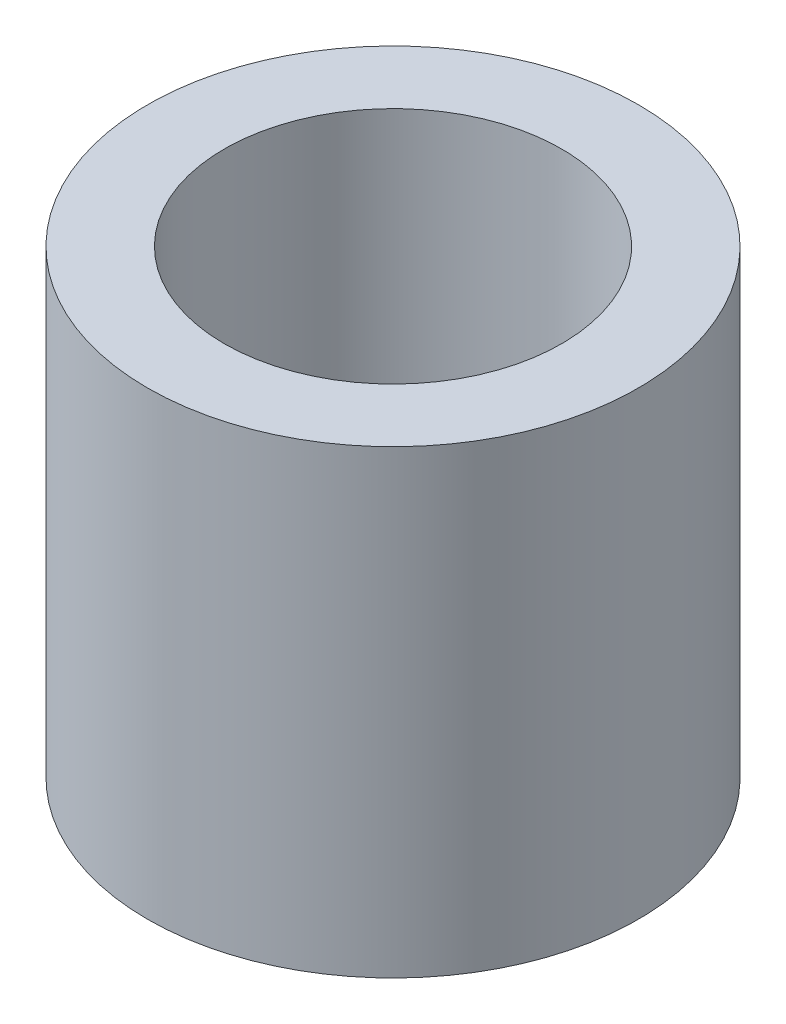
ISO-10303-21;
HEADER;
FILE_DESCRIPTION(('STEP AP214'),'2;1');
FILE_NAME('part.step','',(''),(''),'','','');
FILE_SCHEMA(('AUTOMOTIVE_DESIGN { 1 0 10303 214 1 1 1 1 }'));
ENDSEC;
DATA;
#1=APPLICATION_CONTEXT('core data for automotive mechanical design processes');
#2=APPLICATION_PROTOCOL_DEFINITION('international standard','automotive_design',2000,#1);
#3=PRODUCT_CONTEXT('',#1,'mechanical');
#4=PRODUCT('Part','Part','',(#3));
#5=PRODUCT_RELATED_PRODUCT_CATEGORY('part','',(#4));
#6=PRODUCT_DEFINITION_FORMATION('','',#4);
#7=PRODUCT_DEFINITION_CONTEXT('part definition',#1,'design');
#8=PRODUCT_DEFINITION('design','',#6,#7);
#9=PRODUCT_DEFINITION_SHAPE('','',#8);
#10=(LENGTH_UNIT() NAMED_UNIT(*) SI_UNIT(.MILLI.,.METRE.));
#11=(NAMED_UNIT(*) PLANE_ANGLE_UNIT() SI_UNIT($,.RADIAN.));
#12=(NAMED_UNIT(*) SI_UNIT($,.STERADIAN.) SOLID_ANGLE_UNIT());
#13=UNCERTAINTY_MEASURE_WITH_UNIT(LENGTH_MEASURE(1.E-05),#10,'distance_accuracy_value','');
#14=(GEOMETRIC_REPRESENTATION_CONTEXT(3) GLOBAL_UNCERTAINTY_ASSIGNED_CONTEXT((#13)) GLOBAL_UNIT_ASSIGNED_CONTEXT((#10,
#11,#12)) REPRESENTATION_CONTEXT('',''));
#15=CARTESIAN_POINT('',(0.,0.,0.));
#16=DIRECTION('',(0.,0.,1.));
#17=DIRECTION('',(1.,0.,0.));
#18=AXIS2_PLACEMENT_3D('',#15,#16,#17);
#19=CARTESIAN_POINT('',(0.,2.,0.));
#20=DIRECTION('',(0.,-1.,0.));
#21=DIRECTION('',(0.,0.,-1.));
#22=AXIS2_PLACEMENT_3D('',#19,#20,#21);
#23=CYLINDRICAL_SURFACE('',#22,1.25);
#24=CARTESIAN_POINT('',(0.,2.,0.));
#25=DIRECTION('',(0.,1.,0.));
#26=DIRECTION('',(0.,0.,1.));
#27=AXIS2_PLACEMENT_3D('',#24,#25,#26);
#28=CIRCLE('',#27,1.25);
#29=CARTESIAN_POINT('',(0.,2.,1.25));
#30=VERTEX_POINT('',#29);
#31=EDGE_CURVE('E42',#30,#30,#28,.T.);
#32=ORIENTED_EDGE('',*,*,#31,.T.);
#33=EDGE_LOOP('',(#32));
#34=FACE_BOUND('',#33,.T.);
#35=CARTESIAN_POINT('',(0.,0.,0.));
#36=DIRECTION('',(0.,1.,0.));
#37=DIRECTION('',(0.,0.,1.));
#38=AXIS2_PLACEMENT_3D('',#35,#36,#37);
#39=CIRCLE('',#38,1.25);
#40=CARTESIAN_POINT('',(0.,0.,1.25));
#41=VERTEX_POINT('',#40);
#42=EDGE_CURVE('E51',#41,#41,#39,.T.);
#43=ORIENTED_EDGE('',*,*,#42,.F.);
#44=EDGE_LOOP('',(#43));
#45=FACE_BOUND('',#44,.T.);
#46=ADVANCED_FACE('F35',(#34,#45),#23,.F.);
#47=CARTESIAN_POINT('',(0.,2.,0.));
#48=DIRECTION('',(0.,-1.,0.));
#49=DIRECTION('',(0.,0.,-1.));
#50=AXIS2_PLACEMENT_3D('',#47,#48,#49);
#51=CYLINDRICAL_SURFACE('',#50,4.);
#52=CARTESIAN_POINT('',(0.,0.,0.));
#53=DIRECTION('',(0.,1.,0.));
#54=DIRECTION('',(0.,0.,1.));
#55=AXIS2_PLACEMENT_3D('',#52,#53,#54);
#56=CIRCLE('',#55,4.);
#57=CARTESIAN_POINT('',(0.,0.,4.));
#58=VERTEX_POINT('',#57);
#59=EDGE_CURVE('E38',#58,#58,#56,.T.);
#60=ORIENTED_EDGE('',*,*,#59,.T.);
#61=EDGE_LOOP('',(#60));
#62=FACE_BOUND('',#61,.T.);
#63=CARTESIAN_POINT('',(0.,7.5,0.));
#64=DIRECTION('',(0.,1.,0.));
#65=DIRECTION('',(0.,0.,1.));
#66=AXIS2_PLACEMENT_3D('',#63,#64,#65);
#67=CIRCLE('',#66,4.);
#68=CARTESIAN_POINT('',(0.,7.5,4.));
#69=VERTEX_POINT('',#68);
#70=EDGE_CURVE('E53',#69,#69,#67,.T.);
#71=ORIENTED_EDGE('',*,*,#70,.F.);
#72=EDGE_LOOP('',(#71));
#73=FACE_BOUND('',#72,.T.);
#74=ADVANCED_FACE('F75',(#62,#73),#51,.T.);
#75=CARTESIAN_POINT('',(0.,2.,0.));
#76=DIRECTION('',(0.,1.,0.));
#77=DIRECTION('',(0.,0.,1.));
#78=AXIS2_PLACEMENT_3D('',#75,#76,#77);
#79=PLANE('',#78);
#80=CARTESIAN_POINT('',(0.,2.,0.));
#81=DIRECTION('',(0.,1.,0.));
#82=DIRECTION('',(0.,0.,1.));
#83=AXIS2_PLACEMENT_3D('',#80,#81,#82);
#84=CIRCLE('',#83,2.75);
#85=CARTESIAN_POINT('',(0.,2.,2.75));
#86=VERTEX_POINT('',#85);
#87=EDGE_CURVE('E11',#86,#86,#84,.F.);
#88=ORIENTED_EDGE('',*,*,#87,.F.);
#89=EDGE_LOOP('',(#88));
#90=FACE_BOUND('',#89,.T.);
#91=ORIENTED_EDGE('',*,*,#31,.F.);
#92=EDGE_LOOP('',(#91));
#93=FACE_BOUND('',#92,.T.);
#94=ADVANCED_FACE('F80',(#90,#93),#79,.T.);
#95=CARTESIAN_POINT('',(0.,0.,0.));
#96=DIRECTION('',(0.,1.,0.));
#97=DIRECTION('',(0.,0.,1.));
#98=AXIS2_PLACEMENT_3D('',#95,#96,#97);
#99=PLANE('',#98);
#100=ORIENTED_EDGE('',*,*,#42,.T.);
#101=EDGE_LOOP('',(#100));
#102=FACE_BOUND('',#101,.T.);
#103=ORIENTED_EDGE('',*,*,#59,.F.);
#104=EDGE_LOOP('',(#103));
#105=FACE_BOUND('',#104,.T.);
#106=ADVANCED_FACE('F71',(#102,#105),#99,.F.);
#107=CARTESIAN_POINT('',(0.,24.3137084989848,0.));
#108=DIRECTION('',(0.,-1.,0.));
#109=DIRECTION('',(0.,0.,-1.));
#110=AXIS2_PLACEMENT_3D('',#107,#108,#109);
#111=CYLINDRICAL_SURFACE('',#110,2.75);
#112=ORIENTED_EDGE('',*,*,#87,.T.);
#113=EDGE_LOOP('',(#112));
#114=FACE_BOUND('',#113,.T.);
#115=CARTESIAN_POINT('',(0.,7.5,0.));
#116=DIRECTION('',(0.,1.,0.));
#117=DIRECTION('',(0.,0.,1.));
#118=AXIS2_PLACEMENT_3D('',#115,#116,#117);
#119=CIRCLE('',#118,2.75);
#120=CARTESIAN_POINT('',(0.,7.5,2.75));
#121=VERTEX_POINT('',#120);
#122=EDGE_CURVE('E49',#121,#121,#119,.T.);
#123=ORIENTED_EDGE('',*,*,#122,.T.);
#124=EDGE_LOOP('',(#123));
#125=FACE_BOUND('',#124,.T.);
#126=ADVANCED_FACE('F63',(#114,#125),#111,.F.);
#127=CARTESIAN_POINT('',(0.,7.5,0.));
#128=DIRECTION('',(0.,1.,0.));
#129=DIRECTION('',(0.,0.,1.));
#130=AXIS2_PLACEMENT_3D('',#127,#128,#129);
#131=PLANE('',#130);
#132=ORIENTED_EDGE('',*,*,#122,.F.);
#133=EDGE_LOOP('',(#132));
#134=FACE_BOUND('',#133,.T.);
#135=ORIENTED_EDGE('',*,*,#70,.T.);
#136=EDGE_LOOP('',(#135));
#137=FACE_BOUND('',#136,.T.);
#138=ADVANCED_FACE('F65',(#134,#137),#131,.T.);
#139=CLOSED_SHELL('',(#46,#74,#94,#106,#126,#138));
#140=MANIFOLD_SOLID_BREP('B2',#139);
#141=ADVANCED_BREP_SHAPE_REPRESENTATION('',(#18,#140),#14);
#142=SHAPE_DEFINITION_REPRESENTATION(#9,#141);
ENDSEC;
END-ISO-10303-21;
